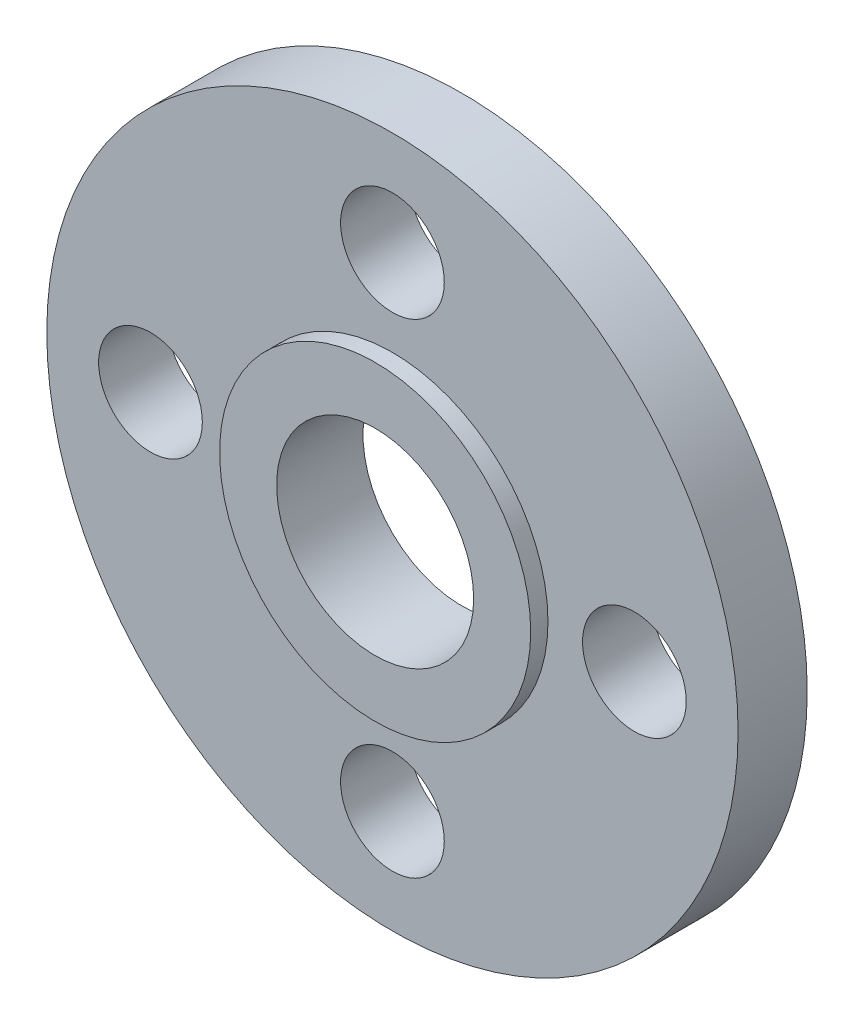
ISO-10303-21;
HEADER;
FILE_DESCRIPTION(('STEP AP214'),'2;1');
FILE_NAME('part.step','',(''),(''),'','','');
FILE_SCHEMA(('AUTOMOTIVE_DESIGN { 1 0 10303 214 1 1 1 1 }'));
ENDSEC;
DATA;
#1=APPLICATION_CONTEXT('core data for automotive mechanical design processes');
#2=APPLICATION_PROTOCOL_DEFINITION('international standard','automotive_design',2000,#1);
#3=PRODUCT_CONTEXT('',#1,'mechanical');
#4=PRODUCT('Part','Part','',(#3));
#5=PRODUCT_RELATED_PRODUCT_CATEGORY('part','',(#4));
#6=PRODUCT_DEFINITION_FORMATION('','',#4);
#7=PRODUCT_DEFINITION_CONTEXT('part definition',#1,'design');
#8=PRODUCT_DEFINITION('design','',#6,#7);
#9=PRODUCT_DEFINITION_SHAPE('','',#8);
#10=(LENGTH_UNIT() NAMED_UNIT(*) SI_UNIT(.MILLI.,.METRE.));
#11=(NAMED_UNIT(*) PLANE_ANGLE_UNIT() SI_UNIT($,.RADIAN.));
#12=(NAMED_UNIT(*) SI_UNIT($,.STERADIAN.) SOLID_ANGLE_UNIT());
#13=UNCERTAINTY_MEASURE_WITH_UNIT(LENGTH_MEASURE(1.E-05),#10,'distance_accuracy_value','');
#14=(GEOMETRIC_REPRESENTATION_CONTEXT(3) GLOBAL_UNCERTAINTY_ASSIGNED_CONTEXT((#13)) GLOBAL_UNIT_ASSIGNED_CONTEXT((#10,
#11,#12)) REPRESENTATION_CONTEXT('',''));
#15=CARTESIAN_POINT('',(0.,0.,0.));
#16=DIRECTION('',(0.,0.,1.));
#17=DIRECTION('',(1.,0.,0.));
#18=AXIS2_PLACEMENT_3D('',#15,#16,#17);
#19=CARTESIAN_POINT('',(0.,0.,2.));
#20=DIRECTION('',(0.,0.,1.));
#21=DIRECTION('',(1.,0.,0.));
#22=AXIS2_PLACEMENT_3D('',#19,#20,#21);
#23=PLANE('',#22);
#24=CARTESIAN_POINT('',(0.,7.,2.));
#25=DIRECTION('',(0.,0.,1.));
#26=DIRECTION('',(1.,0.,0.));
#27=AXIS2_PLACEMENT_3D('',#24,#25,#26);
#28=CIRCLE('',#27,1.5);
#29=CARTESIAN_POINT('',(1.5,7.,2.));
#30=VERTEX_POINT('',#29);
#31=EDGE_CURVE('E73',#30,#30,#28,.T.);
#32=ORIENTED_EDGE('',*,*,#31,.F.);
#33=EDGE_LOOP('',(#32));
#34=FACE_BOUND('',#33,.T.);
#35=CARTESIAN_POINT('',(0.,-7.,2.));
#36=DIRECTION('',(0.,0.,1.));
#37=DIRECTION('',(1.,0.,0.));
#38=AXIS2_PLACEMENT_3D('',#35,#36,#37);
#39=CIRCLE('',#38,1.5);
#40=CARTESIAN_POINT('',(1.5,-7.,2.));
#41=VERTEX_POINT('',#40);
#42=EDGE_CURVE('E67',#41,#41,#39,.T.);
#43=ORIENTED_EDGE('',*,*,#42,.F.);
#44=EDGE_LOOP('',(#43));
#45=FACE_BOUND('',#44,.T.);
#46=CARTESIAN_POINT('',(7.,0.,2.));
#47=DIRECTION('',(0.,0.,1.));
#48=DIRECTION('',(1.,0.,0.));
#49=AXIS2_PLACEMENT_3D('',#46,#47,#48);
#50=CIRCLE('',#49,1.5);
#51=CARTESIAN_POINT('',(8.5,0.,2.));
#52=VERTEX_POINT('',#51);
#53=EDGE_CURVE('E61',#52,#52,#50,.T.);
#54=ORIENTED_EDGE('',*,*,#53,.F.);
#55=EDGE_LOOP('',(#54));
#56=FACE_BOUND('',#55,.T.);
#57=CARTESIAN_POINT('',(-7.,0.,2.));
#58=DIRECTION('',(0.,0.,1.));
#59=DIRECTION('',(1.,0.,0.));
#60=AXIS2_PLACEMENT_3D('',#57,#58,#59);
#61=CIRCLE('',#60,1.5);
#62=CARTESIAN_POINT('',(-5.5,0.,2.));
#63=VERTEX_POINT('',#62);
#64=EDGE_CURVE('E55',#63,#63,#61,.T.);
#65=ORIENTED_EDGE('',*,*,#64,.F.);
#66=EDGE_LOOP('',(#65));
#67=FACE_BOUND('',#66,.T.);
#68=CARTESIAN_POINT('',(0.,0.,2.));
#69=DIRECTION('',(0.,0.,1.));
#70=DIRECTION('',(1.,0.,0.));
#71=AXIS2_PLACEMENT_3D('',#68,#69,#70);
#72=CIRCLE('',#71,10.);
#73=CARTESIAN_POINT('',(10.,0.,2.));
#74=VERTEX_POINT('',#73);
#75=EDGE_CURVE('E10',#74,#74,#72,.T.);
#76=ORIENTED_EDGE('',*,*,#75,.T.);
#77=EDGE_LOOP('',(#76));
#78=FACE_BOUND('',#77,.T.);
#79=CARTESIAN_POINT('',(0.,0.,2.));
#80=DIRECTION('',(0.,0.,1.));
#81=DIRECTION('',(1.,0.,0.));
#82=AXIS2_PLACEMENT_3D('',#79,#80,#81);
#83=CIRCLE('',#82,4.5);
#84=CARTESIAN_POINT('',(4.5,0.,2.));
#85=VERTEX_POINT('',#84);
#86=EDGE_CURVE('E46',#85,#85,#83,.T.);
#87=ORIENTED_EDGE('',*,*,#86,.F.);
#88=EDGE_LOOP('',(#87));
#89=FACE_BOUND('',#88,.T.);
#90=ADVANCED_FACE('F30',(#34,#45,#56,#67,#78,#89),#23,.T.);
#91=CARTESIAN_POINT('',(0.,0.,0.));
#92=DIRECTION('',(0.,0.,1.));
#93=DIRECTION('',(1.,0.,0.));
#94=AXIS2_PLACEMENT_3D('',#91,#92,#93);
#95=PLANE('',#94);
#96=CARTESIAN_POINT('',(0.,7.,0.));
#97=DIRECTION('',(0.,0.,1.));
#98=DIRECTION('',(1.,0.,0.));
#99=AXIS2_PLACEMENT_3D('',#96,#97,#98);
#100=CIRCLE('',#99,1.5);
#101=CARTESIAN_POINT('',(1.5,7.,0.));
#102=VERTEX_POINT('',#101);
#103=EDGE_CURVE('E54',#102,#102,#100,.T.);
#104=ORIENTED_EDGE('',*,*,#103,.T.);
#105=EDGE_LOOP('',(#104));
#106=FACE_BOUND('',#105,.T.);
#107=CARTESIAN_POINT('',(0.,-7.,0.));
#108=DIRECTION('',(0.,0.,1.));
#109=DIRECTION('',(1.,0.,0.));
#110=AXIS2_PLACEMENT_3D('',#107,#108,#109);
#111=CIRCLE('',#110,1.5);
#112=CARTESIAN_POINT('',(1.5,-7.,0.));
#113=VERTEX_POINT('',#112);
#114=EDGE_CURVE('E70',#113,#113,#111,.T.);
#115=ORIENTED_EDGE('',*,*,#114,.T.);
#116=EDGE_LOOP('',(#115));
#117=FACE_BOUND('',#116,.T.);
#118=CARTESIAN_POINT('',(7.,0.,0.));
#119=DIRECTION('',(0.,0.,1.));
#120=DIRECTION('',(1.,0.,0.));
#121=AXIS2_PLACEMENT_3D('',#118,#119,#120);
#122=CIRCLE('',#121,1.5);
#123=CARTESIAN_POINT('',(8.5,0.,0.));
#124=VERTEX_POINT('',#123);
#125=EDGE_CURVE('E64',#124,#124,#122,.T.);
#126=ORIENTED_EDGE('',*,*,#125,.T.);
#127=EDGE_LOOP('',(#126));
#128=FACE_BOUND('',#127,.T.);
#129=CARTESIAN_POINT('',(-7.,0.,0.));
#130=DIRECTION('',(0.,0.,1.));
#131=DIRECTION('',(1.,0.,0.));
#132=AXIS2_PLACEMENT_3D('',#129,#130,#131);
#133=CIRCLE('',#132,1.5);
#134=CARTESIAN_POINT('',(-5.5,0.,0.));
#135=VERTEX_POINT('',#134);
#136=EDGE_CURVE('E58',#135,#135,#133,.T.);
#137=ORIENTED_EDGE('',*,*,#136,.T.);
#138=EDGE_LOOP('',(#137));
#139=FACE_BOUND('',#138,.T.);
#140=CARTESIAN_POINT('',(0.,0.,0.));
#141=DIRECTION('',(0.,0.,1.));
#142=DIRECTION('',(1.,0.,0.));
#143=AXIS2_PLACEMENT_3D('',#140,#141,#142);
#144=CIRCLE('',#143,10.);
#145=CARTESIAN_POINT('',(10.,0.,0.));
#146=VERTEX_POINT('',#145);
#147=EDGE_CURVE('E34',#146,#146,#144,.T.);
#148=ORIENTED_EDGE('',*,*,#147,.F.);
#149=EDGE_LOOP('',(#148));
#150=FACE_BOUND('',#149,.T.);
#151=CARTESIAN_POINT('',(0.,0.,0.));
#152=DIRECTION('',(0.,0.,1.));
#153=DIRECTION('',(1.,0.,0.));
#154=AXIS2_PLACEMENT_3D('',#151,#152,#153);
#155=CIRCLE('',#154,2.85);
#156=CARTESIAN_POINT('',(2.85,0.,0.));
#157=VERTEX_POINT('',#156);
#158=EDGE_CURVE('E41',#157,#157,#155,.T.);
#159=ORIENTED_EDGE('',*,*,#158,.T.);
#160=EDGE_LOOP('',(#159));
#161=FACE_BOUND('',#160,.T.);
#162=ADVANCED_FACE('F79',(#106,#117,#128,#139,#150,#161),#95,.F.);
#163=CARTESIAN_POINT('',(0.,0.,2.));
#164=DIRECTION('',(0.,0.,-1.));
#165=DIRECTION('',(-1.,0.,0.));
#166=AXIS2_PLACEMENT_3D('',#163,#164,#165);
#167=CYLINDRICAL_SURFACE('',#166,10.);
#168=ORIENTED_EDGE('',*,*,#75,.F.);
#169=EDGE_LOOP('',(#168));
#170=FACE_BOUND('',#169,.T.);
#171=ORIENTED_EDGE('',*,*,#147,.T.);
#172=EDGE_LOOP('',(#171));
#173=FACE_BOUND('',#172,.T.);
#174=ADVANCED_FACE('F32',(#170,#173),#167,.T.);
#175=CARTESIAN_POINT('',(0.,0.,2.));
#176=DIRECTION('',(0.,0.,-1.));
#177=DIRECTION('',(-1.,0.,0.));
#178=AXIS2_PLACEMENT_3D('',#175,#176,#177);
#179=CYLINDRICAL_SURFACE('',#178,2.85);
#180=ORIENTED_EDGE('',*,*,#158,.F.);
#181=EDGE_LOOP('',(#180));
#182=FACE_BOUND('',#181,.T.);
#183=CARTESIAN_POINT('',(0.,0.,2.5));
#184=DIRECTION('',(0.,0.,1.));
#185=DIRECTION('',(1.,0.,0.));
#186=AXIS2_PLACEMENT_3D('',#183,#184,#185);
#187=CIRCLE('',#186,2.85);
#188=CARTESIAN_POINT('',(2.85,0.,2.5));
#189=VERTEX_POINT('',#188);
#190=EDGE_CURVE('E49',#189,#189,#187,.T.);
#191=ORIENTED_EDGE('',*,*,#190,.T.);
#192=EDGE_LOOP('',(#191));
#193=FACE_BOUND('',#192,.T.);
#194=ADVANCED_FACE('F113',(#182,#193),#179,.F.);
#195=CARTESIAN_POINT('',(0.,0.,2.5));
#196=DIRECTION('',(0.,0.,1.));
#197=DIRECTION('',(1.,0.,0.));
#198=AXIS2_PLACEMENT_3D('',#195,#196,#197);
#199=PLANE('',#198);
#200=CARTESIAN_POINT('',(0.,0.,2.5));
#201=DIRECTION('',(0.,0.,1.));
#202=DIRECTION('',(1.,0.,0.));
#203=AXIS2_PLACEMENT_3D('',#200,#201,#202);
#204=CIRCLE('',#203,4.5);
#205=CARTESIAN_POINT('',(4.5,0.,2.5));
#206=VERTEX_POINT('',#205);
#207=EDGE_CURVE('E45',#206,#206,#204,.T.);
#208=ORIENTED_EDGE('',*,*,#207,.T.);
#209=EDGE_LOOP('',(#208));
#210=FACE_BOUND('',#209,.T.);
#211=ORIENTED_EDGE('',*,*,#190,.F.);
#212=EDGE_LOOP('',(#211));
#213=FACE_BOUND('',#212,.T.);
#214=ADVANCED_FACE('F103',(#210,#213),#199,.T.);
#215=CARTESIAN_POINT('',(0.,0.,2.5));
#216=DIRECTION('',(0.,0.,-1.));
#217=DIRECTION('',(-1.,0.,0.));
#218=AXIS2_PLACEMENT_3D('',#215,#216,#217);
#219=CYLINDRICAL_SURFACE('',#218,4.5);
#220=ORIENTED_EDGE('',*,*,#207,.F.);
#221=EDGE_LOOP('',(#220));
#222=FACE_BOUND('',#221,.T.);
#223=ORIENTED_EDGE('',*,*,#86,.T.);
#224=EDGE_LOOP('',(#223));
#225=FACE_BOUND('',#224,.T.);
#226=ADVANCED_FACE('F100',(#222,#225),#219,.T.);
#227=CARTESIAN_POINT('',(-7.,0.,0.));
#228=DIRECTION('',(0.,0.,1.));
#229=DIRECTION('',(1.,0.,0.));
#230=AXIS2_PLACEMENT_3D('',#227,#228,#229);
#231=CYLINDRICAL_SURFACE('',#230,1.5);
#232=ORIENTED_EDGE('',*,*,#136,.F.);
#233=EDGE_LOOP('',(#232));
#234=FACE_BOUND('',#233,.T.);
#235=ORIENTED_EDGE('',*,*,#64,.T.);
#236=EDGE_LOOP('',(#235));
#237=FACE_BOUND('',#236,.T.);
#238=ADVANCED_FACE('F102',(#234,#237),#231,.F.);
#239=CARTESIAN_POINT('',(7.,0.,0.));
#240=DIRECTION('',(0.,0.,1.));
#241=DIRECTION('',(1.,0.,0.));
#242=AXIS2_PLACEMENT_3D('',#239,#240,#241);
#243=CYLINDRICAL_SURFACE('',#242,1.5);
#244=ORIENTED_EDGE('',*,*,#125,.F.);
#245=EDGE_LOOP('',(#244));
#246=FACE_BOUND('',#245,.T.);
#247=ORIENTED_EDGE('',*,*,#53,.T.);
#248=EDGE_LOOP('',(#247));
#249=FACE_BOUND('',#248,.T.);
#250=ADVANCED_FACE('F110',(#246,#249),#243,.F.);
#251=CARTESIAN_POINT('',(0.,-7.,0.));
#252=DIRECTION('',(0.,0.,1.));
#253=DIRECTION('',(1.,0.,0.));
#254=AXIS2_PLACEMENT_3D('',#251,#252,#253);
#255=CYLINDRICAL_SURFACE('',#254,1.5);
#256=ORIENTED_EDGE('',*,*,#114,.F.);
#257=EDGE_LOOP('',(#256));
#258=FACE_BOUND('',#257,.T.);
#259=ORIENTED_EDGE('',*,*,#42,.T.);
#260=EDGE_LOOP('',(#259));
#261=FACE_BOUND('',#260,.T.);
#262=ADVANCED_FACE('F85',(#258,#261),#255,.F.);
#263=CARTESIAN_POINT('',(0.,7.,0.));
#264=DIRECTION('',(0.,0.,1.));
#265=DIRECTION('',(1.,0.,0.));
#266=AXIS2_PLACEMENT_3D('',#263,#264,#265);
#267=CYLINDRICAL_SURFACE('',#266,1.5);
#268=ORIENTED_EDGE('',*,*,#103,.F.);
#269=EDGE_LOOP('',(#268));
#270=FACE_BOUND('',#269,.T.);
#271=ORIENTED_EDGE('',*,*,#31,.T.);
#272=EDGE_LOOP('',(#271));
#273=FACE_BOUND('',#272,.T.);
#274=ADVANCED_FACE('F82',(#270,#273),#267,.F.);
#275=CLOSED_SHELL('',(#90,#162,#174,#194,#214,#226,#238,#250,#262,#274));
#276=MANIFOLD_SOLID_BREP('B2',#275);
#277=ADVANCED_BREP_SHAPE_REPRESENTATION('',(#18,#276),#14);
#278=SHAPE_DEFINITION_REPRESENTATION(#9,#277);
ENDSEC;
END-ISO-10303-21;
